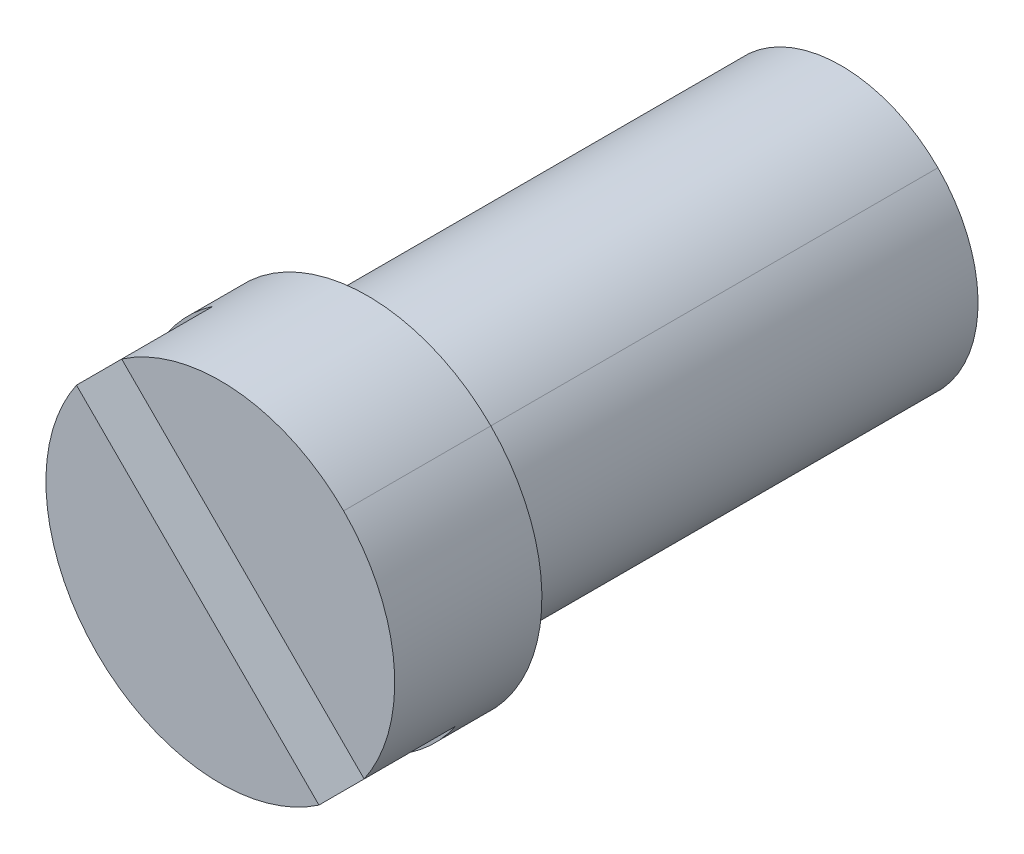
ISO-10303-21;
HEADER;
FILE_DESCRIPTION(('STEP AP214'),'2;1');
FILE_NAME('part.step','',(''),(''),'','','');
FILE_SCHEMA(('AUTOMOTIVE_DESIGN { 1 0 10303 214 1 1 1 1 }'));
ENDSEC;
DATA;
#1=APPLICATION_CONTEXT('core data for automotive mechanical design processes');
#2=APPLICATION_PROTOCOL_DEFINITION('international standard','automotive_design',2000,#1);
#3=PRODUCT_CONTEXT('',#1,'mechanical');
#4=PRODUCT('Part','Part','',(#3));
#5=PRODUCT_RELATED_PRODUCT_CATEGORY('part','',(#4));
#6=PRODUCT_DEFINITION_FORMATION('','',#4);
#7=PRODUCT_DEFINITION_CONTEXT('part definition',#1,'design');
#8=PRODUCT_DEFINITION('design','',#6,#7);
#9=PRODUCT_DEFINITION_SHAPE('','',#8);
#10=(LENGTH_UNIT() NAMED_UNIT(*) SI_UNIT(.MILLI.,.METRE.));
#11=(NAMED_UNIT(*) PLANE_ANGLE_UNIT() SI_UNIT($,.RADIAN.));
#12=(NAMED_UNIT(*) SI_UNIT($,.STERADIAN.) SOLID_ANGLE_UNIT());
#13=UNCERTAINTY_MEASURE_WITH_UNIT(LENGTH_MEASURE(1.E-05),#10,'distance_accuracy_value','');
#14=(GEOMETRIC_REPRESENTATION_CONTEXT(3) GLOBAL_UNCERTAINTY_ASSIGNED_CONTEXT((#13)) GLOBAL_UNIT_ASSIGNED_CONTEXT((#10,
#11,#12)) REPRESENTATION_CONTEXT('',''));
#15=CARTESIAN_POINT('',(0.,0.,0.));
#16=DIRECTION('',(0.,0.,1.));
#17=DIRECTION('',(1.,0.,0.));
#18=AXIS2_PLACEMENT_3D('',#15,#16,#17);
#19=CARTESIAN_POINT('',(22.860343805971,5.27034380597093,8.76943375672969));
#20=DIRECTION('',(0.,0.,1.));
#21=DIRECTION('',(0.707106781186547,0.707106781186548,0.));
#22=AXIS2_PLACEMENT_3D('',#19,#20,#21);
#23=CYLINDRICAL_SURFACE('',#22,1.5);
#24=DIRECTION('',(0.,0.,-1.));
#25=VECTOR('',#24,1.);
#26=CARTESIAN_POINT('',(23.9210039777508,6.33100397775075,8.76943375672969));
#27=LINE('',#26,#25);
#28=CARTESIAN_POINT('',(23.9210039777508,6.33100397775075,12.0176388374866));
#29=VERTEX_POINT('',#28);
#30=CARTESIAN_POINT('',(23.9210039777508,6.33100397775075,6.83));
#31=VERTEX_POINT('',#30);
#32=EDGE_CURVE('E28',#29,#31,#27,.T.);
#33=ORIENTED_EDGE('',*,*,#32,.F.);
#34=CARTESIAN_POINT('',(22.860343805971,5.27034380597093,12.0176388374866));
#35=DIRECTION('',(0.,0.,-1.));
#36=DIRECTION('',(0.707106781186547,0.707106781186548,0.));
#37=AXIS2_PLACEMENT_3D('',#34,#35,#36);
#38=CIRCLE('',#37,1.5);
#39=CARTESIAN_POINT('',(21.7996836341912,4.20968363419111,12.0176388374866));
#40=VERTEX_POINT('',#39);
#41=EDGE_CURVE('E151',#29,#40,#38,.T.);
#42=ORIENTED_EDGE('',*,*,#41,.T.);
#43=DIRECTION('',(0.,0.,-1.));
#44=VECTOR('',#43,1.);
#45=CARTESIAN_POINT('',(21.7996836341912,4.20968363419111,8.76943375672969));
#46=LINE('',#45,#44);
#47=CARTESIAN_POINT('',(21.7996836341912,4.20968363419111,6.83));
#48=VERTEX_POINT('',#47);
#49=EDGE_CURVE('E60',#40,#48,#46,.T.);
#50=ORIENTED_EDGE('',*,*,#49,.T.);
#51=CARTESIAN_POINT('',(22.860343805971,5.27034380597093,6.83));
#52=DIRECTION('',(0.,0.,-1.));
#53=DIRECTION('',(0.707106781186547,0.707106781186548,0.));
#54=AXIS2_PLACEMENT_3D('',#51,#52,#53);
#55=CIRCLE('',#54,1.5);
#56=EDGE_CURVE('E116',#31,#48,#55,.T.);
#57=ORIENTED_EDGE('',*,*,#56,.F.);
#58=EDGE_LOOP('',(#33,#42,#50,#57));
#59=FACE_BOUND('',#58,.T.);
#60=ADVANCED_FACE('F17',(#59),#23,.T.);
#61=CARTESIAN_POINT('',(22.860343805971,5.27034380597093,12.8238194187433));
#62=DIRECTION('',(0.,0.,-1.));
#63=DIRECTION('',(0.707106781186545,0.70710678118655,0.));
#64=AXIS2_PLACEMENT_3D('',#61,#62,#63);
#65=CYLINDRICAL_SURFACE('',#64,1.91034380597093);
#66=DIRECTION('',(0.,0.,1.));
#67=VECTOR('',#66,1.);
#68=CARTESIAN_POINT('',(21.5095267463712,3.91952674637119,12.8238194187433));
#69=LINE('',#68,#67);
#70=CARTESIAN_POINT('',(21.5095267463712,3.91952674637119,12.0176388374866));
#71=VERTEX_POINT('',#70);
#72=CARTESIAN_POINT('',(21.5095267463712,3.91952674637119,13.63));
#73=VERTEX_POINT('',#72);
#74=EDGE_CURVE('E168',#71,#73,#69,.T.);
#75=ORIENTED_EDGE('',*,*,#74,.T.);
#76=CARTESIAN_POINT('',(22.860343805971,5.27034380597093,13.63));
#77=DIRECTION('',(0.,0.,1.));
#78=DIRECTION('',(0.707106781186545,0.70710678118655,0.));
#79=AXIS2_PLACEMENT_3D('',#76,#77,#78);
#80=CIRCLE('',#79,1.91034380597093);
#81=CARTESIAN_POINT('',(21.2849043519045,6.35080851320685,13.63));
#82=VERTEX_POINT('',#81);
#83=EDGE_CURVE('E21',#82,#73,#80,.T.);
#84=ORIENTED_EDGE('',*,*,#83,.F.);
#85=DIRECTION('',(0.,0.,1.));
#86=VECTOR('',#85,1.);
#87=CARTESIAN_POINT('',(21.2849043519045,6.35080851320685,12.8238194187433));
#88=LINE('',#87,#86);
#89=CARTESIAN_POINT('',(21.2849043519045,6.35080851320685,12.63));
#90=VERTEX_POINT('',#89);
#91=EDGE_CURVE('E111',#90,#82,#88,.T.);
#92=ORIENTED_EDGE('',*,*,#91,.F.);
#93=CARTESIAN_POINT('',(22.860343805971,5.27034380597093,12.63));
#94=DIRECTION('',(0.,0.,1.));
#95=DIRECTION('',(0.707106781186545,0.70710678118655,0.));
#96=AXIS2_PLACEMENT_3D('',#93,#94,#95);
#97=CIRCLE('',#96,1.91034380597093);
#98=CARTESIAN_POINT('',(21.7798790987351,6.84578326003743,12.63));
#99=VERTEX_POINT('',#98);
#100=EDGE_CURVE('E104',#99,#90,#97,.T.);
#101=ORIENTED_EDGE('',*,*,#100,.F.);
#102=DIRECTION('',(0.,0.,1.));
#103=VECTOR('',#102,1.);
#104=CARTESIAN_POINT('',(21.7798790987351,6.84578326003743,12.8238194187433));
#105=LINE('',#104,#103);
#106=CARTESIAN_POINT('',(21.7798790987351,6.84578326003743,13.63));
#107=VERTEX_POINT('',#106);
#108=EDGE_CURVE('E108',#99,#107,#105,.T.);
#109=ORIENTED_EDGE('',*,*,#108,.T.);
#110=CARTESIAN_POINT('',(22.860343805971,5.27034380597093,13.63));
#111=DIRECTION('',(0.,0.,1.));
#112=DIRECTION('',(0.707106781186545,0.70710678118655,0.));
#113=AXIS2_PLACEMENT_3D('',#110,#111,#112);
#114=CIRCLE('',#113,1.91034380597093);
#115=CARTESIAN_POINT('',(24.2111608655707,6.62116086557068,13.63));
#116=VERTEX_POINT('',#115);
#117=EDGE_CURVE('E11',#116,#107,#114,.T.);
#118=ORIENTED_EDGE('',*,*,#117,.F.);
#119=DIRECTION('',(0.,0.,1.));
#120=VECTOR('',#119,1.);
#121=CARTESIAN_POINT('',(24.2111608655707,6.62116086557068,12.8238194187433));
#122=LINE('',#121,#120);
#123=CARTESIAN_POINT('',(24.2111608655707,6.62116086557068,12.0176388374866));
#124=VERTEX_POINT('',#123);
#125=EDGE_CURVE('E183',#124,#116,#122,.T.);
#126=ORIENTED_EDGE('',*,*,#125,.F.);
#127=CARTESIAN_POINT('',(22.860343805971,5.27034380597093,12.0176388374866));
#128=DIRECTION('',(0.,0.,-1.));
#129=DIRECTION('',(0.70710678118655,-0.707106781186545,0.));
#130=AXIS2_PLACEMENT_3D('',#127,#128,#129);
#131=CIRCLE('',#130,1.91034380597093);
#132=EDGE_CURVE('E162',#71,#124,#131,.T.);
#133=ORIENTED_EDGE('',*,*,#132,.F.);
#134=EDGE_LOOP('',(#75,#84,#92,#101,#109,#118,#126,#133));
#135=FACE_BOUND('',#134,.T.);
#136=ADVANCED_FACE('F106',(#135),#65,.T.);
#137=CARTESIAN_POINT('',(23.9622202938885,4.16846731805341,13.63));
#138=DIRECTION('',(0.,0.,-1.));
#139=DIRECTION('',(0.,-1.,0.));
#140=AXIS2_PLACEMENT_3D('',#137,#138,#139);
#141=PLANE('',#140);
#142=DIRECTION('',(-0.707106781186548,0.707106781186547,0.));
#143=VECTOR('',#142,1.);
#144=CARTESIAN_POINT('',(23.1078311793863,5.51783117938623,13.63));
#145=LINE('',#144,#143);
#146=CARTESIAN_POINT('',(24.4357832600374,4.1898790987351,13.63));
#147=VERTEX_POINT('',#146);
#148=EDGE_CURVE('E129',#147,#107,#145,.T.);
#149=ORIENTED_EDGE('',*,*,#148,.F.);
#150=CARTESIAN_POINT('',(22.860343805971,5.27034380597093,13.63));
#151=DIRECTION('',(0.,0.,1.));
#152=DIRECTION('',(0.707106781186545,0.70710678118655,0.));
#153=AXIS2_PLACEMENT_3D('',#150,#151,#152);
#154=CIRCLE('',#153,1.91034380597093);
#155=EDGE_CURVE('E178',#147,#116,#154,.T.);
#156=ORIENTED_EDGE('',*,*,#155,.T.);
#157=ORIENTED_EDGE('',*,*,#117,.T.);
#158=EDGE_LOOP('',(#149,#156,#157));
#159=FACE_BOUND('',#158,.T.);
#160=ADVANCED_FACE('F210',(#159),#141,.F.);
#161=CARTESIAN_POINT('',(22.860343805971,5.27034380597093,8.76943375672969));
#162=DIRECTION('',(0.,0.,1.));
#163=DIRECTION('',(0.707106781186547,0.707106781186548,0.));
#164=AXIS2_PLACEMENT_3D('',#161,#162,#163);
#165=CYLINDRICAL_SURFACE('',#164,1.5);
#166=CARTESIAN_POINT('',(22.860343805971,5.27034380597093,6.83));
#167=DIRECTION('',(0.,0.,-1.));
#168=DIRECTION('',(0.707106781186547,0.707106781186548,0.));
#169=AXIS2_PLACEMENT_3D('',#166,#167,#168);
#170=CIRCLE('',#169,1.5);
#171=EDGE_CURVE('E161',#48,#31,#170,.T.);
#172=ORIENTED_EDGE('',*,*,#171,.F.);
#173=ORIENTED_EDGE('',*,*,#49,.F.);
#174=CARTESIAN_POINT('',(22.860343805971,5.27034380597093,12.0176388374866));
#175=DIRECTION('',(0.,0.,-1.));
#176=DIRECTION('',(0.707106781186547,0.707106781186548,0.));
#177=AXIS2_PLACEMENT_3D('',#174,#175,#176);
#178=CIRCLE('',#177,1.5);
#179=EDGE_CURVE('E153',#40,#29,#178,.T.);
#180=ORIENTED_EDGE('',*,*,#179,.T.);
#181=ORIENTED_EDGE('',*,*,#32,.T.);
#182=EDGE_LOOP('',(#172,#173,#180,#181));
#183=FACE_BOUND('',#182,.T.);
#184=ADVANCED_FACE('F208',(#183),#165,.T.);
#185=CARTESIAN_POINT('',(21.4956260212247,7.13003633754783,12.63));
#186=DIRECTION('',(0.,0.,-1.));
#187=DIRECTION('',(0.,-1.,0.));
#188=AXIS2_PLACEMENT_3D('',#185,#186,#187);
#189=PLANE('',#188);
#190=DIRECTION('',(-0.707106781186548,0.707106781186547,0.));
#191=VECTOR('',#190,1.);
#192=CARTESIAN_POINT('',(23.1078311793863,5.51783117938623,12.63));
#193=LINE('',#192,#191);
#194=CARTESIAN_POINT('',(24.4357832600374,4.1898790987351,12.63));
#195=VERTEX_POINT('',#194);
#196=EDGE_CURVE('E119',#195,#99,#193,.T.);
#197=ORIENTED_EDGE('',*,*,#196,.T.);
#198=ORIENTED_EDGE('',*,*,#100,.T.);
#199=DIRECTION('',(0.707106781186548,-0.707106781186547,0.));
#200=VECTOR('',#199,1.);
#201=CARTESIAN_POINT('',(22.6128564325557,5.02285643255565,12.63));
#202=LINE('',#201,#200);
#203=CARTESIAN_POINT('',(23.9408085132068,3.69490435190452,12.63));
#204=VERTEX_POINT('',#203);
#205=EDGE_CURVE('E142',#90,#204,#202,.T.);
#206=ORIENTED_EDGE('',*,*,#205,.T.);
#207=CARTESIAN_POINT('',(22.860343805971,5.27034380597093,12.63));
#208=DIRECTION('',(0.,0.,1.));
#209=DIRECTION('',(0.707106781186545,0.70710678118655,0.));
#210=AXIS2_PLACEMENT_3D('',#207,#208,#209);
#211=CIRCLE('',#210,1.91034380597093);
#212=EDGE_CURVE('E121',#204,#195,#211,.T.);
#213=ORIENTED_EDGE('',*,*,#212,.T.);
#214=EDGE_LOOP('',(#197,#198,#206,#213));
#215=FACE_BOUND('',#214,.T.);
#216=ADVANCED_FACE('F120',(#215),#189,.F.);
#217=CARTESIAN_POINT('',(22.4625962415535,4.8725962415535,6.83));
#218=DIRECTION('',(0.,0.,1.));
#219=DIRECTION('',(0.,-1.,0.));
#220=AXIS2_PLACEMENT_3D('',#217,#218,#219);
#221=PLANE('',#220);
#222=ORIENTED_EDGE('',*,*,#171,.T.);
#223=ORIENTED_EDGE('',*,*,#56,.T.);
#224=EDGE_LOOP('',(#222,#223));
#225=FACE_BOUND('',#224,.T.);
#226=ADVANCED_FACE('F206',(#225),#221,.F.);
#227=CARTESIAN_POINT('',(23.9622202938885,4.16846731805341,13.63));
#228=DIRECTION('',(0.,0.,-1.));
#229=DIRECTION('',(0.,-1.,0.));
#230=AXIS2_PLACEMENT_3D('',#227,#228,#229);
#231=PLANE('',#230);
#232=CARTESIAN_POINT('',(22.860343805971,5.27034380597093,13.63));
#233=DIRECTION('',(0.,0.,1.));
#234=DIRECTION('',(0.707106781186545,0.70710678118655,0.));
#235=AXIS2_PLACEMENT_3D('',#232,#233,#234);
#236=CIRCLE('',#235,1.91034380597093);
#237=CARTESIAN_POINT('',(23.9408085132068,3.69490435190452,13.63));
#238=VERTEX_POINT('',#237);
#239=EDGE_CURVE('E171',#73,#238,#236,.T.);
#240=ORIENTED_EDGE('',*,*,#239,.T.);
#241=DIRECTION('',(0.707106781186548,-0.707106781186547,0.));
#242=VECTOR('',#241,1.);
#243=CARTESIAN_POINT('',(22.6128564325557,5.02285643255565,13.63));
#244=LINE('',#243,#242);
#245=EDGE_CURVE('E143',#82,#238,#244,.T.);
#246=ORIENTED_EDGE('',*,*,#245,.F.);
#247=ORIENTED_EDGE('',*,*,#83,.T.);
#248=EDGE_LOOP('',(#240,#246,#247));
#249=FACE_BOUND('',#248,.T.);
#250=ADVANCED_FACE('F235',(#249),#231,.F.);
#251=CARTESIAN_POINT('',(24.025585149397,4.10510246254486,12.0176388374866));
#252=DIRECTION('',(0.,0.,1.));
#253=DIRECTION('',(0.,-1.,0.));
#254=AXIS2_PLACEMENT_3D('',#251,#252,#253);
#255=PLANE('',#254);
#256=ORIENTED_EDGE('',*,*,#179,.F.);
#257=ORIENTED_EDGE('',*,*,#41,.F.);
#258=EDGE_LOOP('',(#256,#257));
#259=FACE_BOUND('',#258,.T.);
#260=CARTESIAN_POINT('',(22.860343805971,5.27034380597093,12.0176388374866));
#261=DIRECTION('',(0.,0.,-1.));
#262=DIRECTION('',(0.70710678118655,-0.707106781186545,0.));
#263=AXIS2_PLACEMENT_3D('',#260,#261,#262);
#264=CIRCLE('',#263,1.91034380597093);
#265=EDGE_CURVE('E150',#124,#71,#264,.T.);
#266=ORIENTED_EDGE('',*,*,#265,.T.);
#267=ORIENTED_EDGE('',*,*,#132,.T.);
#268=EDGE_LOOP('',(#266,#267));
#269=FACE_BOUND('',#268,.T.);
#270=ADVANCED_FACE('F232',(#259,#269),#255,.F.);
#271=CARTESIAN_POINT('',(22.860343805971,5.27034380597093,12.8238194187433));
#272=DIRECTION('',(0.,0.,-1.));
#273=DIRECTION('',(0.707106781186545,0.70710678118655,0.));
#274=AXIS2_PLACEMENT_3D('',#271,#272,#273);
#275=CYLINDRICAL_SURFACE('',#274,1.91034380597093);
#276=ORIENTED_EDGE('',*,*,#265,.F.);
#277=ORIENTED_EDGE('',*,*,#125,.T.);
#278=ORIENTED_EDGE('',*,*,#155,.F.);
#279=DIRECTION('',(0.,0.,1.));
#280=VECTOR('',#279,1.);
#281=CARTESIAN_POINT('',(24.4357832600374,4.1898790987351,12.8238194187433));
#282=LINE('',#281,#280);
#283=EDGE_CURVE('E126',#195,#147,#282,.T.);
#284=ORIENTED_EDGE('',*,*,#283,.F.);
#285=ORIENTED_EDGE('',*,*,#212,.F.);
#286=DIRECTION('',(0.,0.,1.));
#287=VECTOR('',#286,1.);
#288=CARTESIAN_POINT('',(23.9408085132068,3.69490435190452,12.8238194187433));
#289=LINE('',#288,#287);
#290=EDGE_CURVE('E147',#204,#238,#289,.T.);
#291=ORIENTED_EDGE('',*,*,#290,.T.);
#292=ORIENTED_EDGE('',*,*,#239,.F.);
#293=ORIENTED_EDGE('',*,*,#74,.F.);
#294=EDGE_LOOP('',(#276,#277,#278,#284,#285,#291,#292,#293));
#295=FACE_BOUND('',#294,.T.);
#296=ADVANCED_FACE('F234',(#295),#275,.T.);
#297=CARTESIAN_POINT('',(21.0006512743941,6.63506159071725,12.63));
#298=DIRECTION('',(-0.707106781186547,-0.707106781186548,0.));
#299=DIRECTION('',(-0.707106781186548,0.707106781186547,0.));
#300=AXIS2_PLACEMENT_3D('',#297,#298,#299);
#301=PLANE('',#300);
#302=ORIENTED_EDGE('',*,*,#205,.F.);
#303=ORIENTED_EDGE('',*,*,#91,.T.);
#304=ORIENTED_EDGE('',*,*,#245,.T.);
#305=ORIENTED_EDGE('',*,*,#290,.F.);
#306=EDGE_LOOP('',(#302,#303,#304,#305));
#307=FACE_BOUND('',#306,.T.);
#308=ADVANCED_FACE('F242',(#307),#301,.F.);
#309=CARTESIAN_POINT('',(21.4956260212247,7.13003633754783,14.515608753973));
#310=DIRECTION('',(0.707106781186547,0.707106781186548,0.));
#311=DIRECTION('',(0.,0.,-1.));
#312=AXIS2_PLACEMENT_3D('',#309,#310,#311);
#313=PLANE('',#312);
#314=ORIENTED_EDGE('',*,*,#148,.T.);
#315=ORIENTED_EDGE('',*,*,#108,.F.);
#316=ORIENTED_EDGE('',*,*,#196,.F.);
#317=ORIENTED_EDGE('',*,*,#283,.T.);
#318=EDGE_LOOP('',(#314,#315,#316,#317));
#319=FACE_BOUND('',#318,.T.);
#320=ADVANCED_FACE('F19',(#319),#313,.F.);
#321=CLOSED_SHELL('',(#60,#136,#160,#184,#216,#226,#250,#270,#296,#308,#320));
#322=MANIFOLD_SOLID_BREP('B1',#321);
#323=ADVANCED_BREP_SHAPE_REPRESENTATION('',(#18,#322),#14);
#324=SHAPE_DEFINITION_REPRESENTATION(#9,#323);
ENDSEC;
END-ISO-10303-21;
